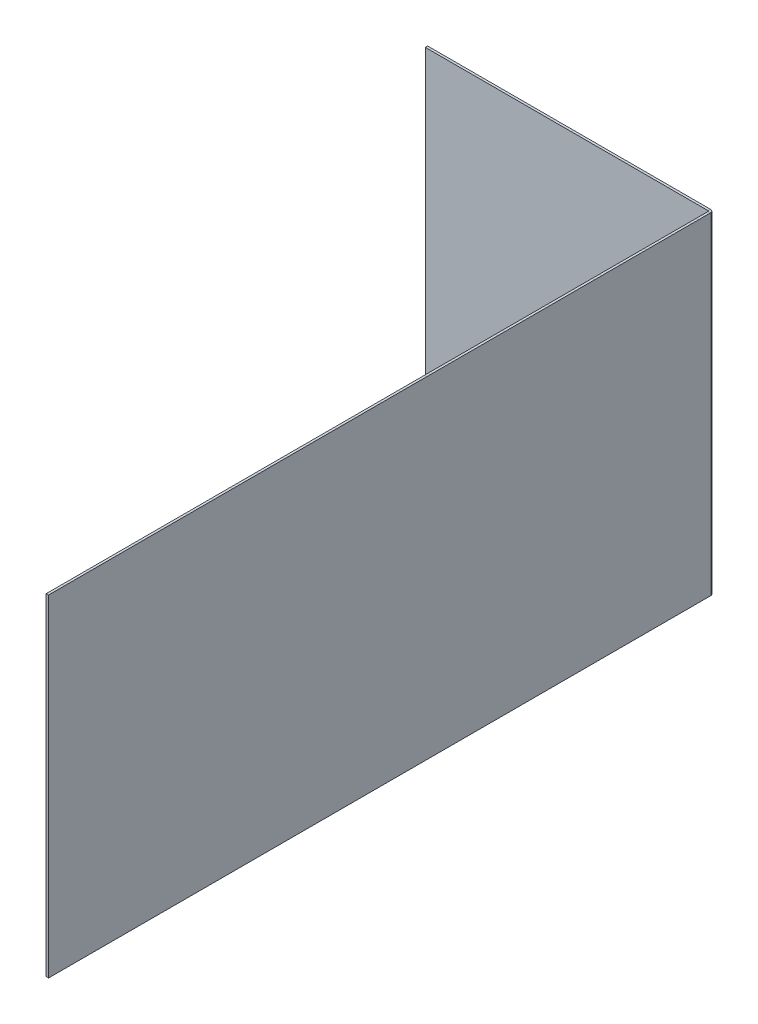
ISO-10303-21;
HEADER;
FILE_DESCRIPTION(('STEP AP214'),'2;1');
FILE_NAME('part.step','',(''),(''),'','','');
FILE_SCHEMA(('AUTOMOTIVE_DESIGN { 1 0 10303 214 1 1 1 1 }'));
ENDSEC;
DATA;
#1=APPLICATION_CONTEXT('core data for automotive mechanical design processes');
#2=APPLICATION_PROTOCOL_DEFINITION('international standard','automotive_design',2000,#1);
#3=PRODUCT_CONTEXT('',#1,'mechanical');
#4=PRODUCT('Part','Part','',(#3));
#5=PRODUCT_RELATED_PRODUCT_CATEGORY('part','',(#4));
#6=PRODUCT_DEFINITION_FORMATION('','',#4);
#7=PRODUCT_DEFINITION_CONTEXT('part definition',#1,'design');
#8=PRODUCT_DEFINITION('design','',#6,#7);
#9=PRODUCT_DEFINITION_SHAPE('','',#8);
#10=(LENGTH_UNIT() NAMED_UNIT(*) SI_UNIT(.MILLI.,.METRE.));
#11=(NAMED_UNIT(*) PLANE_ANGLE_UNIT() SI_UNIT($,.RADIAN.));
#12=(NAMED_UNIT(*) SI_UNIT($,.STERADIAN.) SOLID_ANGLE_UNIT());
#13=UNCERTAINTY_MEASURE_WITH_UNIT(LENGTH_MEASURE(1.E-05),#10,'distance_accuracy_value','');
#14=(GEOMETRIC_REPRESENTATION_CONTEXT(3) GLOBAL_UNCERTAINTY_ASSIGNED_CONTEXT((#13)) GLOBAL_UNIT_ASSIGNED_CONTEXT((#10,
#11,#12)) REPRESENTATION_CONTEXT('',''));
#15=CARTESIAN_POINT('',(0.,0.,0.));
#16=DIRECTION('',(0.,0.,1.));
#17=DIRECTION('',(1.,0.,0.));
#18=AXIS2_PLACEMENT_3D('',#15,#16,#17);
#19=CARTESIAN_POINT('',(-305.230620045327,177.8,-204.900620045326));
#20=DIRECTION('',(1.,0.,0.));
#21=DIRECTION('',(0.,-1.,0.));
#22=AXIS2_PLACEMENT_3D('',#19,#20,#21);
#23=PLANE('',#22);
#24=DIRECTION('',(0.,1.,0.));
#25=VECTOR('',#24,1.);
#26=CARTESIAN_POINT('',(-305.230620045327,177.8,-202.360620045326));
#27=LINE('',#26,#25);
#28=CARTESIAN_POINT('',(-305.230620045327,-177.8,-202.360620045326));
#29=VERTEX_POINT('',#28);
#30=CARTESIAN_POINT('',(-305.230620045327,177.8,-202.360620045326));
#31=VERTEX_POINT('',#30);
#32=EDGE_CURVE('E149',#29,#31,#27,.T.);
#33=ORIENTED_EDGE('',*,*,#32,.T.);
#34=DIRECTION('',(0.,0.,1.));
#35=VECTOR('',#34,1.);
#36=CARTESIAN_POINT('',(-305.230620045327,177.8,-204.900620045326));
#37=LINE('',#36,#35);
#38=CARTESIAN_POINT('',(-305.230620045327,177.8,-204.900620045326));
#39=VERTEX_POINT('',#38);
#40=EDGE_CURVE('E144',#39,#31,#37,.T.);
#41=ORIENTED_EDGE('',*,*,#40,.F.);
#42=DIRECTION('',(0.,1.,0.));
#43=VECTOR('',#42,1.);
#44=CARTESIAN_POINT('',(-305.230620045327,177.8,-204.900620045326));
#45=LINE('',#44,#43);
#46=CARTESIAN_POINT('',(-305.230620045327,-177.8,-204.900620045326));
#47=VERTEX_POINT('',#46);
#48=EDGE_CURVE('E45',#47,#39,#45,.T.);
#49=ORIENTED_EDGE('',*,*,#48,.F.);
#50=DIRECTION('',(0.,0.,1.));
#51=VECTOR('',#50,1.);
#52=CARTESIAN_POINT('',(-305.230620045327,-177.8,-204.900620045326));
#53=LINE('',#52,#51);
#54=EDGE_CURVE('E146',#47,#29,#53,.T.);
#55=ORIENTED_EDGE('',*,*,#54,.T.);
#56=EDGE_LOOP('',(#33,#41,#49,#55));
#57=FACE_BOUND('',#56,.T.);
#58=ADVANCED_FACE('F35',(#57),#23,.F.);
#59=CARTESIAN_POINT('',(710.769379954673,177.8,-204.900620045329));
#60=DIRECTION('',(0.,-1.,0.));
#61=DIRECTION('',(-1.,0.,0.));
#62=AXIS2_PLACEMENT_3D('',#59,#60,#61);
#63=PLANE('',#62);
#64=DIRECTION('',(0.,0.,1.));
#65=VECTOR('',#64,1.);
#66=CARTESIAN_POINT('',(-2.00660000000003,177.8,-204.900620045327));
#67=LINE('',#66,#65);
#68=CARTESIAN_POINT('',(-2.0066,177.8,-204.900620045327));
#69=VERTEX_POINT('',#68);
#70=CARTESIAN_POINT('',(-2.0066,177.8,-202.360620045327));
#71=VERTEX_POINT('',#70);
#72=EDGE_CURVE('E39',#69,#71,#67,.T.);
#73=ORIENTED_EDGE('',*,*,#72,.F.);
#74=DIRECTION('',(1.,0.,0.));
#75=VECTOR('',#74,1.);
#76=CARTESIAN_POINT('',(710.769379954673,177.8,-204.900620045329));
#77=LINE('',#76,#75);
#78=EDGE_CURVE('E75',#39,#69,#77,.T.);
#79=ORIENTED_EDGE('',*,*,#78,.F.);
#80=ORIENTED_EDGE('',*,*,#40,.T.);
#81=DIRECTION('',(1.,0.,0.));
#82=VECTOR('',#81,1.);
#83=CARTESIAN_POINT('',(710.769379954673,177.8,-202.360620045329));
#84=LINE('',#83,#82);
#85=EDGE_CURVE('E54',#31,#71,#84,.T.);
#86=ORIENTED_EDGE('',*,*,#85,.T.);
#87=EDGE_LOOP('',(#73,#79,#80,#86));
#88=FACE_BOUND('',#87,.T.);
#89=ADVANCED_FACE('F204',(#88),#63,.F.);
#90=CARTESIAN_POINT('',(202.769379954673,0.,-204.900620045327));
#91=DIRECTION('',(0.,0.,-1.));
#92=DIRECTION('',(-1.,0.,0.));
#93=AXIS2_PLACEMENT_3D('',#90,#91,#92);
#94=PLANE('',#93);
#95=ORIENTED_EDGE('',*,*,#78,.T.);
#96=DIRECTION('',(0.,-1.,0.));
#97=VECTOR('',#96,1.);
#98=CARTESIAN_POINT('',(-2.0066,0.,-204.900620045327));
#99=LINE('',#98,#97);
#100=CARTESIAN_POINT('',(-2.00659999999997,-177.8,-204.900620045327));
#101=VERTEX_POINT('',#100);
#102=EDGE_CURVE('E139',#69,#101,#99,.T.);
#103=ORIENTED_EDGE('',*,*,#102,.T.);
#104=DIRECTION('',(-1.,0.,0.));
#105=VECTOR('',#104,1.);
#106=CARTESIAN_POINT('',(710.769379954673,-177.8,-204.900620045329));
#107=LINE('',#106,#105);
#108=EDGE_CURVE('E137',#101,#47,#107,.T.);
#109=ORIENTED_EDGE('',*,*,#108,.T.);
#110=ORIENTED_EDGE('',*,*,#48,.T.);
#111=EDGE_LOOP('',(#95,#103,#109,#110));
#112=FACE_BOUND('',#111,.T.);
#113=ADVANCED_FACE('F210',(#112),#94,.T.);
#114=CARTESIAN_POINT('',(710.769379954673,-177.8,-204.900620045329));
#115=DIRECTION('',(0.,1.,0.));
#116=DIRECTION('',(1.,0.,0.));
#117=AXIS2_PLACEMENT_3D('',#114,#115,#116);
#118=PLANE('',#117);
#119=DIRECTION('',(0.,0.,-1.));
#120=VECTOR('',#119,1.);
#121=CARTESIAN_POINT('',(-2.00659999999997,-177.8,-204.900620045327));
#122=LINE('',#121,#120);
#123=CARTESIAN_POINT('',(-2.00659999999999,-177.8,-202.360620045327));
#124=VERTEX_POINT('',#123);
#125=EDGE_CURVE('E152',#124,#101,#122,.T.);
#126=ORIENTED_EDGE('',*,*,#125,.F.);
#127=DIRECTION('',(-1.,0.,0.));
#128=VECTOR('',#127,1.);
#129=CARTESIAN_POINT('',(710.769379954673,-177.8,-202.360620045329));
#130=LINE('',#129,#128);
#131=EDGE_CURVE('E11',#124,#29,#130,.T.);
#132=ORIENTED_EDGE('',*,*,#131,.T.);
#133=ORIENTED_EDGE('',*,*,#54,.F.);
#134=ORIENTED_EDGE('',*,*,#108,.F.);
#135=EDGE_LOOP('',(#126,#132,#133,#134));
#136=FACE_BOUND('',#135,.T.);
#137=ADVANCED_FACE('F216',(#136),#118,.F.);
#138=CARTESIAN_POINT('',(202.769379954673,0.,-202.360620045327));
#139=DIRECTION('',(0.,0.,-1.));
#140=DIRECTION('',(-1.,0.,0.));
#141=AXIS2_PLACEMENT_3D('',#138,#139,#140);
#142=PLANE('',#141);
#143=DIRECTION('',(0.,-1.,0.));
#144=VECTOR('',#143,1.);
#145=CARTESIAN_POINT('',(-2.0066,0.,-202.360620045327));
#146=LINE('',#145,#144);
#147=EDGE_CURVE('E153',#71,#124,#146,.T.);
#148=ORIENTED_EDGE('',*,*,#147,.F.);
#149=ORIENTED_EDGE('',*,*,#85,.F.);
#150=ORIENTED_EDGE('',*,*,#32,.F.);
#151=ORIENTED_EDGE('',*,*,#131,.F.);
#152=EDGE_LOOP('',(#148,#149,#150,#151));
#153=FACE_BOUND('',#152,.T.);
#154=ADVANCED_FACE('F37',(#153),#142,.F.);
#155=CARTESIAN_POINT('',(1.27,177.8,508.));
#156=DIRECTION('',(0.,-1.,0.));
#157=DIRECTION('',(0.,0.,-1.));
#158=AXIS2_PLACEMENT_3D('',#155,#156,#157);
#159=PLANE('',#158);
#160=DIRECTION('',(0.,0.,1.));
#161=VECTOR('',#160,1.);
#162=CARTESIAN_POINT('',(1.27,177.8,508.));
#163=LINE('',#162,#161);
#164=CARTESIAN_POINT('',(1.27,177.8,-201.624020045327));
#165=VERTEX_POINT('',#164);
#166=CARTESIAN_POINT('',(1.27,177.8,508.));
#167=VERTEX_POINT('',#166);
#168=EDGE_CURVE('E127',#165,#167,#163,.T.);
#169=ORIENTED_EDGE('',*,*,#168,.F.);
#170=DIRECTION('',(-1.,0.,0.));
#171=VECTOR('',#170,1.);
#172=CARTESIAN_POINT('',(1.27000000000004,177.8,-201.624020045327));
#173=LINE('',#172,#171);
#174=CARTESIAN_POINT('',(-1.27,177.8,-201.624020045327));
#175=VERTEX_POINT('',#174);
#176=EDGE_CURVE('E161',#165,#175,#173,.T.);
#177=ORIENTED_EDGE('',*,*,#176,.T.);
#178=DIRECTION('',(0.,0.,1.));
#179=VECTOR('',#178,1.);
#180=CARTESIAN_POINT('',(-1.27,177.8,508.));
#181=LINE('',#180,#179);
#182=CARTESIAN_POINT('',(-1.27,177.8,508.));
#183=VERTEX_POINT('',#182);
#184=EDGE_CURVE('E116',#175,#183,#181,.T.);
#185=ORIENTED_EDGE('',*,*,#184,.T.);
#186=DIRECTION('',(-1.,0.,0.));
#187=VECTOR('',#186,1.);
#188=CARTESIAN_POINT('',(1.27,177.8,508.));
#189=LINE('',#188,#187);
#190=EDGE_CURVE('E111',#167,#183,#189,.T.);
#191=ORIENTED_EDGE('',*,*,#190,.F.);
#192=EDGE_LOOP('',(#169,#177,#185,#191));
#193=FACE_BOUND('',#192,.T.);
#194=ADVANCED_FACE('F185',(#193),#159,.F.);
#195=CARTESIAN_POINT('',(1.27,-177.8,508.));
#196=DIRECTION('',(0.,1.,0.));
#197=DIRECTION('',(0.,0.,1.));
#198=AXIS2_PLACEMENT_3D('',#195,#196,#197);
#199=PLANE('',#198);
#200=DIRECTION('',(0.,0.,-1.));
#201=VECTOR('',#200,1.);
#202=CARTESIAN_POINT('',(-1.27,-177.8,508.));
#203=LINE('',#202,#201);
#204=CARTESIAN_POINT('',(-1.27,-177.8,508.));
#205=VERTEX_POINT('',#204);
#206=CARTESIAN_POINT('',(-1.27,-177.8,-201.624020045327));
#207=VERTEX_POINT('',#206);
#208=EDGE_CURVE('E115',#205,#207,#203,.T.);
#209=ORIENTED_EDGE('',*,*,#208,.T.);
#210=DIRECTION('',(1.,0.,0.));
#211=VECTOR('',#210,1.);
#212=CARTESIAN_POINT('',(1.27000000000004,-177.8,-201.624020045327));
#213=LINE('',#212,#211);
#214=CARTESIAN_POINT('',(1.27,-177.8,-201.624020045327));
#215=VERTEX_POINT('',#214);
#216=EDGE_CURVE('E166',#207,#215,#213,.T.);
#217=ORIENTED_EDGE('',*,*,#216,.T.);
#218=DIRECTION('',(0.,0.,-1.));
#219=VECTOR('',#218,1.);
#220=CARTESIAN_POINT('',(1.27,-177.8,508.));
#221=LINE('',#220,#219);
#222=CARTESIAN_POINT('',(1.27,-177.8,508.));
#223=VERTEX_POINT('',#222);
#224=EDGE_CURVE('E122',#223,#215,#221,.T.);
#225=ORIENTED_EDGE('',*,*,#224,.F.);
#226=DIRECTION('',(-1.,0.,0.));
#227=VECTOR('',#226,1.);
#228=CARTESIAN_POINT('',(1.27,-177.8,508.));
#229=LINE('',#228,#227);
#230=EDGE_CURVE('E108',#223,#205,#229,.T.);
#231=ORIENTED_EDGE('',*,*,#230,.T.);
#232=EDGE_LOOP('',(#209,#217,#225,#231));
#233=FACE_BOUND('',#232,.T.);
#234=ADVANCED_FACE('F120',(#233),#199,.F.);
#235=CARTESIAN_POINT('',(-1.27,0.,0.));
#236=DIRECTION('',(1.,0.,0.));
#237=DIRECTION('',(0.,0.,-1.));
#238=AXIS2_PLACEMENT_3D('',#235,#236,#237);
#239=PLANE('',#238);
#240=ORIENTED_EDGE('',*,*,#184,.F.);
#241=DIRECTION('',(0.,-1.,0.));
#242=VECTOR('',#241,1.);
#243=CARTESIAN_POINT('',(-1.27,0.,-201.624020045327));
#244=LINE('',#243,#242);
#245=EDGE_CURVE('E126',#175,#207,#244,.T.);
#246=ORIENTED_EDGE('',*,*,#245,.T.);
#247=ORIENTED_EDGE('',*,*,#208,.F.);
#248=DIRECTION('',(0.,-1.,0.));
#249=VECTOR('',#248,1.);
#250=CARTESIAN_POINT('',(-1.27,177.8,508.));
#251=LINE('',#250,#249);
#252=EDGE_CURVE('E105',#183,#205,#251,.T.);
#253=ORIENTED_EDGE('',*,*,#252,.F.);
#254=EDGE_LOOP('',(#240,#246,#247,#253));
#255=FACE_BOUND('',#254,.T.);
#256=ADVANCED_FACE('F125',(#255),#239,.F.);
#257=CARTESIAN_POINT('',(1.27,177.8,508.));
#258=DIRECTION('',(0.,0.,-1.));
#259=DIRECTION('',(0.,1.,0.));
#260=AXIS2_PLACEMENT_3D('',#257,#258,#259);
#261=PLANE('',#260);
#262=ORIENTED_EDGE('',*,*,#252,.T.);
#263=ORIENTED_EDGE('',*,*,#230,.F.);
#264=DIRECTION('',(0.,-1.,0.));
#265=VECTOR('',#264,1.);
#266=CARTESIAN_POINT('',(1.27,177.8,508.));
#267=LINE('',#266,#265);
#268=EDGE_CURVE('E92',#167,#223,#267,.T.);
#269=ORIENTED_EDGE('',*,*,#268,.F.);
#270=ORIENTED_EDGE('',*,*,#190,.T.);
#271=EDGE_LOOP('',(#262,#263,#269,#270));
#272=FACE_BOUND('',#271,.T.);
#273=ADVANCED_FACE('F107',(#272),#261,.F.);
#274=CARTESIAN_POINT('',(1.27,0.,0.));
#275=DIRECTION('',(1.,0.,0.));
#276=DIRECTION('',(0.,0.,-1.));
#277=AXIS2_PLACEMENT_3D('',#274,#275,#276);
#278=PLANE('',#277);
#279=DIRECTION('',(0.,-1.,0.));
#280=VECTOR('',#279,1.);
#281=CARTESIAN_POINT('',(1.27,0.,-201.624020045327));
#282=LINE('',#281,#280);
#283=EDGE_CURVE('E132',#165,#215,#282,.T.);
#284=ORIENTED_EDGE('',*,*,#283,.F.);
#285=ORIENTED_EDGE('',*,*,#168,.T.);
#286=ORIENTED_EDGE('',*,*,#268,.T.);
#287=ORIENTED_EDGE('',*,*,#224,.T.);
#288=EDGE_LOOP('',(#284,#285,#286,#287));
#289=FACE_BOUND('',#288,.T.);
#290=ADVANCED_FACE('F184',(#289),#278,.T.);
#291=CARTESIAN_POINT('',(-2.0066,177.8,-201.624020045327));
#292=DIRECTION('',(0.,1.,0.));
#293=DIRECTION('',(0.,0.,1.));
#294=AXIS2_PLACEMENT_3D('',#291,#292,#293);
#295=PLANE('',#294);
#296=ORIENTED_EDGE('',*,*,#72,.T.);
#297=CARTESIAN_POINT('',(-2.0066,177.8,-201.624020045327));
#298=DIRECTION('',(0.,-1.,0.));
#299=DIRECTION('',(0.,0.,-1.));
#300=AXIS2_PLACEMENT_3D('',#297,#298,#299);
#301=CIRCLE('',#300,0.736600000000002);
#302=EDGE_CURVE('E178',#71,#175,#301,.T.);
#303=ORIENTED_EDGE('',*,*,#302,.T.);
#304=ORIENTED_EDGE('',*,*,#176,.F.);
#305=CARTESIAN_POINT('',(-2.0066,177.8,-201.624020045327));
#306=DIRECTION('',(0.,-1.,0.));
#307=DIRECTION('',(0.,0.,-1.));
#308=AXIS2_PLACEMENT_3D('',#305,#306,#307);
#309=CIRCLE('',#308,3.2766);
#310=EDGE_CURVE('E177',#69,#165,#309,.T.);
#311=ORIENTED_EDGE('',*,*,#310,.F.);
#312=EDGE_LOOP('',(#296,#303,#304,#311));
#313=FACE_BOUND('',#312,.T.);
#314=ADVANCED_FACE('F191',(#313),#295,.T.);
#315=CARTESIAN_POINT('',(-2.0066,-177.8,-201.624020045327));
#316=DIRECTION('',(0.,-1.,0.));
#317=DIRECTION('',(0.,0.,-1.));
#318=AXIS2_PLACEMENT_3D('',#315,#316,#317);
#319=PLANE('',#318);
#320=CARTESIAN_POINT('',(-2.0066,-177.8,-201.624020045327));
#321=DIRECTION('',(0.,-1.,0.));
#322=DIRECTION('',(0.,0.,-1.));
#323=AXIS2_PLACEMENT_3D('',#320,#321,#322);
#324=CIRCLE('',#323,0.736600000000002);
#325=EDGE_CURVE('E83',#207,#124,#324,.F.);
#326=ORIENTED_EDGE('',*,*,#325,.T.);
#327=ORIENTED_EDGE('',*,*,#125,.T.);
#328=CARTESIAN_POINT('',(-2.0066,-177.8,-201.624020045327));
#329=DIRECTION('',(0.,-1.,0.));
#330=DIRECTION('',(0.,0.,-1.));
#331=AXIS2_PLACEMENT_3D('',#328,#329,#330);
#332=CIRCLE('',#331,3.2766);
#333=EDGE_CURVE('E69',#215,#101,#332,.F.);
#334=ORIENTED_EDGE('',*,*,#333,.F.);
#335=ORIENTED_EDGE('',*,*,#216,.F.);
#336=EDGE_LOOP('',(#326,#327,#334,#335));
#337=FACE_BOUND('',#336,.T.);
#338=ADVANCED_FACE('F193',(#337),#319,.T.);
#339=CARTESIAN_POINT('',(-2.0066,1254.2356978473,-201.624020045327));
#340=DIRECTION('',(0.,-1.,0.));
#341=DIRECTION('',(0.,0.,-1.));
#342=AXIS2_PLACEMENT_3D('',#339,#340,#341);
#343=CYLINDRICAL_SURFACE('',#342,3.2766);
#344=ORIENTED_EDGE('',*,*,#283,.T.);
#345=ORIENTED_EDGE('',*,*,#333,.T.);
#346=ORIENTED_EDGE('',*,*,#102,.F.);
#347=ORIENTED_EDGE('',*,*,#310,.T.);
#348=EDGE_LOOP('',(#344,#345,#346,#347));
#349=FACE_BOUND('',#348,.T.);
#350=ADVANCED_FACE('F182',(#349),#343,.T.);
#351=CARTESIAN_POINT('',(-2.0066,1254.2356978473,-201.624020045327));
#352=DIRECTION('',(0.,-1.,0.));
#353=DIRECTION('',(0.,0.,-1.));
#354=AXIS2_PLACEMENT_3D('',#351,#352,#353);
#355=CYLINDRICAL_SURFACE('',#354,0.736600000000002);
#356=ORIENTED_EDGE('',*,*,#245,.F.);
#357=ORIENTED_EDGE('',*,*,#302,.F.);
#358=ORIENTED_EDGE('',*,*,#147,.T.);
#359=ORIENTED_EDGE('',*,*,#325,.F.);
#360=EDGE_LOOP('',(#356,#357,#358,#359));
#361=FACE_BOUND('',#360,.T.);
#362=ADVANCED_FACE('F190',(#361),#355,.F.);
#363=CLOSED_SHELL('',(#58,#89,#113,#137,#154,#194,#234,#256,#273,#290,#314,#338,#350,#362));
#364=MANIFOLD_SOLID_BREP('B2',#363);
#365=ADVANCED_BREP_SHAPE_REPRESENTATION('',(#18,#364),#14);
#366=SHAPE_DEFINITION_REPRESENTATION(#9,#365);
ENDSEC;
END-ISO-10303-21;
